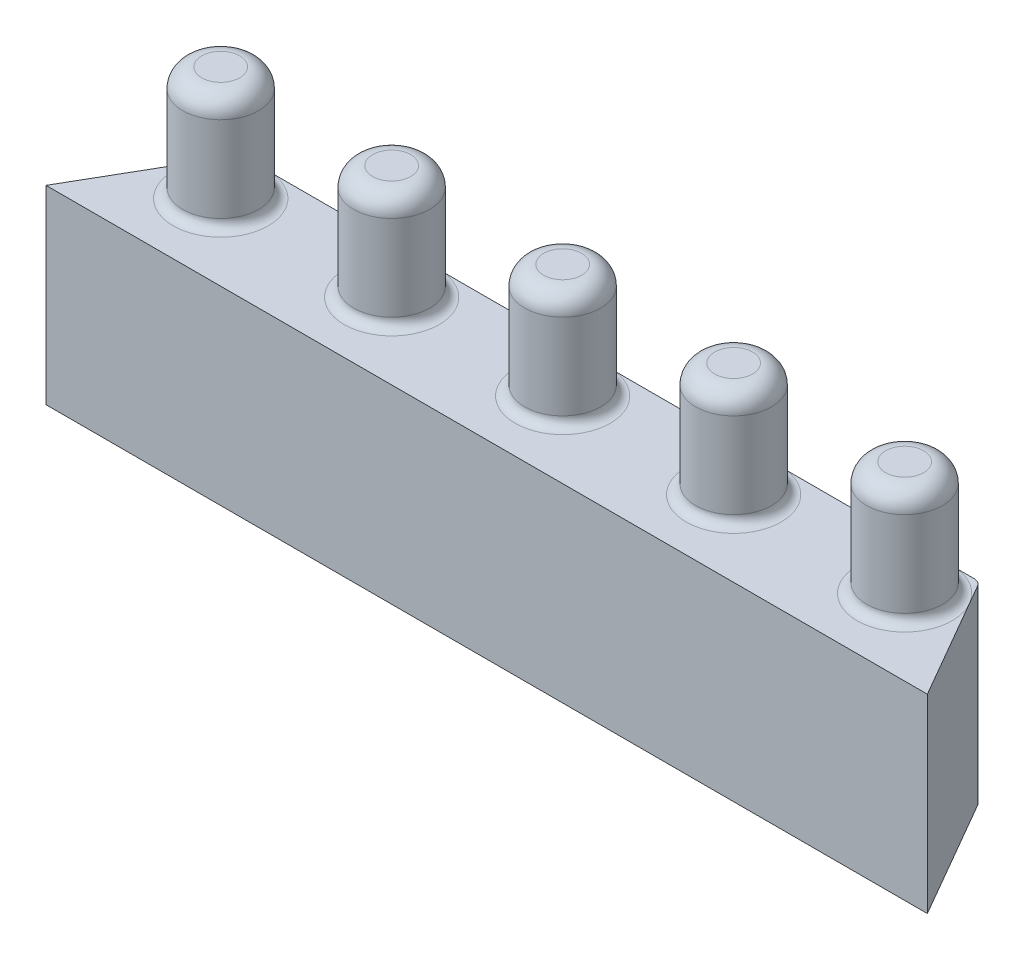
ISO-10303-21;
HEADER;
FILE_DESCRIPTION(('STEP AP214'),'2;1');
FILE_NAME('part.step','',(''),(''),'','','');
FILE_SCHEMA(('AUTOMOTIVE_DESIGN { 1 0 10303 214 1 1 1 1 }'));
ENDSEC;
DATA;
#1=APPLICATION_CONTEXT('core data for automotive mechanical design processes');
#2=APPLICATION_PROTOCOL_DEFINITION('international standard','automotive_design',2000,#1);
#3=PRODUCT_CONTEXT('',#1,'mechanical');
#4=PRODUCT('Part','Part','',(#3));
#5=PRODUCT_RELATED_PRODUCT_CATEGORY('part','',(#4));
#6=PRODUCT_DEFINITION_FORMATION('','',#4);
#7=PRODUCT_DEFINITION_CONTEXT('part definition',#1,'design');
#8=PRODUCT_DEFINITION('design','',#6,#7);
#9=PRODUCT_DEFINITION_SHAPE('','',#8);
#10=(LENGTH_UNIT() NAMED_UNIT(*) SI_UNIT(.MILLI.,.METRE.));
#11=(NAMED_UNIT(*) PLANE_ANGLE_UNIT() SI_UNIT($,.RADIAN.));
#12=(NAMED_UNIT(*) SI_UNIT($,.STERADIAN.) SOLID_ANGLE_UNIT());
#13=UNCERTAINTY_MEASURE_WITH_UNIT(LENGTH_MEASURE(1.E-05),#10,'distance_accuracy_value','');
#14=(GEOMETRIC_REPRESENTATION_CONTEXT(3) GLOBAL_UNCERTAINTY_ASSIGNED_CONTEXT((#13)) GLOBAL_UNIT_ASSIGNED_CONTEXT((#10,
#11,#12)) REPRESENTATION_CONTEXT('',''));
#15=CARTESIAN_POINT('',(0.,0.,0.));
#16=DIRECTION('',(0.,0.,1.));
#17=DIRECTION('',(1.,0.,0.));
#18=AXIS2_PLACEMENT_3D('',#15,#16,#17);
#19=CARTESIAN_POINT('',(0.,10.,0.));
#20=DIRECTION('',(0.,1.,0.));
#21=DIRECTION('',(0.,0.,1.));
#22=AXIS2_PLACEMENT_3D('',#19,#20,#21);
#23=PLANE('',#22);
#24=DIRECTION('',(-0.500000000000005,0.,-0.866025403784436));
#25=VECTOR('',#24,1.);
#26=CARTESIAN_POINT('',(37.443375672974,10.,-2.5));
#27=LINE('',#26,#25);
#28=CARTESIAN_POINT('',(38.1650635094611,10.,-1.25000000000001));
#29=VERTEX_POINT('',#28);
#30=CARTESIAN_POINT('',(37.5877132402715,10.,-2.25000000000001));
#31=VERTEX_POINT('',#30);
#32=EDGE_CURVE('E130',#29,#31,#27,.T.);
#33=ORIENTED_EDGE('',*,*,#32,.T.);
#34=CARTESIAN_POINT('',(37.1547005383792,10.,-2.));
#35=DIRECTION('',(0.,1.,0.));
#36=DIRECTION('',(0.,0.,1.));
#37=AXIS2_PLACEMENT_3D('',#34,#35,#36);
#38=CIRCLE('',#37,0.5);
#39=CARTESIAN_POINT('',(37.1547005383792,10.,-2.5));
#40=VERTEX_POINT('',#39);
#41=EDGE_CURVE('E199',#31,#40,#38,.T.);
#42=ORIENTED_EDGE('',*,*,#41,.T.);
#43=DIRECTION('',(-1.,0.,0.));
#44=VECTOR('',#43,1.);
#45=CARTESIAN_POINT('',(-1.44337567297406,10.,-2.5));
#46=LINE('',#45,#44);
#47=CARTESIAN_POINT('',(36.,10.,-2.5));
#48=VERTEX_POINT('',#47);
#49=EDGE_CURVE('E142',#40,#48,#46,.T.);
#50=ORIENTED_EDGE('',*,*,#49,.T.);
#51=CARTESIAN_POINT('',(36.,10.,0.));
#52=DIRECTION('',(0.,1.,0.));
#53=DIRECTION('',(0.,0.,1.));
#54=AXIS2_PLACEMENT_3D('',#51,#52,#53);
#55=CIRCLE('',#54,2.5);
#56=EDGE_CURVE('E197',#48,#29,#55,.F.);
#57=ORIENTED_EDGE('',*,*,#56,.T.);
#58=EDGE_LOOP('',(#33,#42,#50,#57));
#59=FACE_BOUND('',#58,.T.);
#60=ADVANCED_FACE('F33',(#59),#23,.T.);
#61=CARTESIAN_POINT('',(0.,10.,-2.5));
#62=VERTEX_POINT('',#61);
#63=CARTESIAN_POINT('',(-1.15470053837925,10.,-2.5));
#64=VERTEX_POINT('',#63);
#65=EDGE_CURVE('E558',#62,#64,#46,.T.);
#66=ORIENTED_EDGE('',*,*,#65,.T.);
#67=CARTESIAN_POINT('',(-1.15470053837925,10.,-2.));
#68=DIRECTION('',(0.,1.,0.));
#69=DIRECTION('',(0.,0.,1.));
#70=AXIS2_PLACEMENT_3D('',#67,#68,#69);
#71=CIRCLE('',#70,0.5);
#72=CARTESIAN_POINT('',(-1.58771324027146,10.,-2.25));
#73=VERTEX_POINT('',#72);
#74=EDGE_CURVE('E201',#64,#73,#71,.T.);
#75=ORIENTED_EDGE('',*,*,#74,.T.);
#76=DIRECTION('',(-0.500000000000004,0.,0.866025403784436));
#77=VECTOR('',#76,1.);
#78=CARTESIAN_POINT('',(-1.44337567297406,10.,-2.5));
#79=LINE('',#78,#77);
#80=CARTESIAN_POINT('',(-2.16506350946109,10.,-1.25000000000001));
#81=VERTEX_POINT('',#80);
#82=EDGE_CURVE('E120',#73,#81,#79,.T.);
#83=ORIENTED_EDGE('',*,*,#82,.T.);
#84=CARTESIAN_POINT('',(0.,10.,0.));
#85=DIRECTION('',(0.,1.,0.));
#86=DIRECTION('',(0.,0.,1.));
#87=AXIS2_PLACEMENT_3D('',#84,#85,#86);
#88=CIRCLE('',#87,2.5);
#89=EDGE_CURVE('E184',#81,#62,#88,.F.);
#90=ORIENTED_EDGE('',*,*,#89,.T.);
#91=EDGE_LOOP('',(#66,#75,#83,#90));
#92=FACE_BOUND('',#91,.T.);
#93=ADVANCED_FACE('F231',(#92),#23,.T.);
#94=CARTESIAN_POINT('',(41.1961524227067,10.,4.));
#95=VERTEX_POINT('',#94);
#96=EDGE_CURVE('E562',#95,#29,#27,.T.);
#97=ORIENTED_EDGE('',*,*,#96,.T.);
#98=CARTESIAN_POINT('',(36.,10.,0.));
#99=DIRECTION('',(0.,1.,0.));
#100=DIRECTION('',(0.,0.,1.));
#101=AXIS2_PLACEMENT_3D('',#98,#99,#100);
#102=CIRCLE('',#101,2.5);
#103=EDGE_CURVE('E55',#29,#48,#102,.F.);
#104=ORIENTED_EDGE('',*,*,#103,.T.);
#105=CARTESIAN_POINT('',(27.,10.,-2.5));
#106=VERTEX_POINT('',#105);
#107=EDGE_CURVE('E548',#48,#106,#46,.T.);
#108=ORIENTED_EDGE('',*,*,#107,.T.);
#109=CARTESIAN_POINT('',(27.,10.,0.));
#110=DIRECTION('',(0.,1.,0.));
#111=DIRECTION('',(0.,0.,1.));
#112=AXIS2_PLACEMENT_3D('',#109,#110,#111);
#113=CIRCLE('',#112,2.5);
#114=EDGE_CURVE('E193',#106,#106,#113,.F.);
#115=ORIENTED_EDGE('',*,*,#114,.T.);
#116=CARTESIAN_POINT('',(18.,10.,-2.5));
#117=VERTEX_POINT('',#116);
#118=EDGE_CURVE('E546',#106,#117,#46,.T.);
#119=ORIENTED_EDGE('',*,*,#118,.T.);
#120=CARTESIAN_POINT('',(18.,10.,0.));
#121=DIRECTION('',(0.,1.,0.));
#122=DIRECTION('',(0.,0.,1.));
#123=AXIS2_PLACEMENT_3D('',#120,#121,#122);
#124=CIRCLE('',#123,2.50000000000004);
#125=EDGE_CURVE('E190',#117,#117,#124,.F.);
#126=ORIENTED_EDGE('',*,*,#125,.T.);
#127=CARTESIAN_POINT('',(9.,10.,-2.5));
#128=VERTEX_POINT('',#127);
#129=EDGE_CURVE('E555',#117,#128,#46,.T.);
#130=ORIENTED_EDGE('',*,*,#129,.T.);
#131=CARTESIAN_POINT('',(9.,10.,0.));
#132=DIRECTION('',(0.,1.,0.));
#133=DIRECTION('',(0.,0.,1.));
#134=AXIS2_PLACEMENT_3D('',#131,#132,#133);
#135=CIRCLE('',#134,2.5);
#136=EDGE_CURVE('E187',#128,#128,#135,.F.);
#137=ORIENTED_EDGE('',*,*,#136,.T.);
#138=EDGE_CURVE('E557',#128,#62,#46,.T.);
#139=ORIENTED_EDGE('',*,*,#138,.T.);
#140=CARTESIAN_POINT('',(0.,10.,0.));
#141=DIRECTION('',(0.,1.,0.));
#142=DIRECTION('',(0.,0.,1.));
#143=AXIS2_PLACEMENT_3D('',#140,#141,#142);
#144=CIRCLE('',#143,2.5);
#145=EDGE_CURVE('E115',#62,#81,#144,.F.);
#146=ORIENTED_EDGE('',*,*,#145,.T.);
#147=CARTESIAN_POINT('',(-5.19615242270667,10.,4.));
#148=VERTEX_POINT('',#147);
#149=EDGE_CURVE('E108',#81,#148,#79,.T.);
#150=ORIENTED_EDGE('',*,*,#149,.T.);
#151=DIRECTION('',(1.,0.,0.));
#152=VECTOR('',#151,1.);
#153=CARTESIAN_POINT('',(-5.19615242270667,10.,4.));
#154=LINE('',#153,#152);
#155=EDGE_CURVE('E112',#148,#95,#154,.T.);
#156=ORIENTED_EDGE('',*,*,#155,.T.);
#157=EDGE_LOOP('',(#97,#104,#108,#115,#119,#126,#130,#137,#139,#146,#150,#156));
#158=FACE_BOUND('',#157,.T.);
#159=ADVANCED_FACE('F111',(#158),#23,.T.);
#160=CARTESIAN_POINT('',(0.,0.,0.));
#161=DIRECTION('',(0.,1.,0.));
#162=DIRECTION('',(0.,0.,1.));
#163=AXIS2_PLACEMENT_3D('',#160,#161,#162);
#164=PLANE('',#163);
#165=DIRECTION('',(-0.500000000000004,0.,0.866025403784436));
#166=VECTOR('',#165,1.);
#167=CARTESIAN_POINT('',(-1.44337567297406,0.,-2.5));
#168=LINE('',#167,#166);
#169=CARTESIAN_POINT('',(-1.58771324027146,0.,-2.25));
#170=VERTEX_POINT('',#169);
#171=CARTESIAN_POINT('',(-5.19615242270667,0.,4.));
#172=VERTEX_POINT('',#171);
#173=EDGE_CURVE('E135',#170,#172,#168,.T.);
#174=ORIENTED_EDGE('',*,*,#173,.F.);
#175=CARTESIAN_POINT('',(-1.15470053837925,0.,-2.));
#176=DIRECTION('',(0.,1.,0.));
#177=DIRECTION('',(0.,0.,1.));
#178=AXIS2_PLACEMENT_3D('',#175,#176,#177);
#179=CIRCLE('',#178,0.5);
#180=CARTESIAN_POINT('',(-1.15470053837925,0.,-2.5));
#181=VERTEX_POINT('',#180);
#182=EDGE_CURVE('E176',#170,#181,#179,.F.);
#183=ORIENTED_EDGE('',*,*,#182,.T.);
#184=DIRECTION('',(-1.,0.,0.));
#185=VECTOR('',#184,1.);
#186=CARTESIAN_POINT('',(-1.44337567297406,0.,-2.5));
#187=LINE('',#186,#185);
#188=CARTESIAN_POINT('',(37.1547005383792,0.,-2.5));
#189=VERTEX_POINT('',#188);
#190=EDGE_CURVE('E121',#189,#181,#187,.T.);
#191=ORIENTED_EDGE('',*,*,#190,.F.);
#192=CARTESIAN_POINT('',(37.1547005383792,0.,-2.));
#193=DIRECTION('',(0.,1.,0.));
#194=DIRECTION('',(0.,0.,1.));
#195=AXIS2_PLACEMENT_3D('',#192,#193,#194);
#196=CIRCLE('',#195,0.5);
#197=CARTESIAN_POINT('',(37.5877132402715,0.,-2.25000000000001));
#198=VERTEX_POINT('',#197);
#199=EDGE_CURVE('E174',#189,#198,#196,.F.);
#200=ORIENTED_EDGE('',*,*,#199,.T.);
#201=DIRECTION('',(-0.500000000000005,0.,-0.866025403784436));
#202=VECTOR('',#201,1.);
#203=CARTESIAN_POINT('',(37.443375672974,0.,-2.5));
#204=LINE('',#203,#202);
#205=CARTESIAN_POINT('',(41.1961524227067,0.,4.));
#206=VERTEX_POINT('',#205);
#207=EDGE_CURVE('E566',#206,#198,#204,.T.);
#208=ORIENTED_EDGE('',*,*,#207,.F.);
#209=DIRECTION('',(1.,0.,0.));
#210=VECTOR('',#209,1.);
#211=CARTESIAN_POINT('',(-5.19615242270667,0.,4.));
#212=LINE('',#211,#210);
#213=EDGE_CURVE('E564',#172,#206,#212,.T.);
#214=ORIENTED_EDGE('',*,*,#213,.F.);
#215=EDGE_LOOP('',(#174,#183,#191,#200,#208,#214));
#216=FACE_BOUND('',#215,.T.);
#217=ADVANCED_FACE('F241',(#216),#164,.F.);
#218=CARTESIAN_POINT('',(-1.44337567297406,10.,-2.5));
#219=DIRECTION('',(0.866025403784436,0.,0.500000000000004));
#220=DIRECTION('',(0.500000000000004,0.,-0.866025403784436));
#221=AXIS2_PLACEMENT_3D('',#218,#219,#220);
#222=PLANE('',#221);
#223=ORIENTED_EDGE('',*,*,#82,.F.);
#224=DIRECTION('',(0.,-1.,0.));
#225=VECTOR('',#224,1.);
#226=CARTESIAN_POINT('',(-1.58771324027146,10.,-2.25));
#227=LINE('',#226,#225);
#228=EDGE_CURVE('E172',#73,#170,#227,.T.);
#229=ORIENTED_EDGE('',*,*,#228,.T.);
#230=ORIENTED_EDGE('',*,*,#173,.T.);
#231=DIRECTION('',(0.,-1.,0.));
#232=VECTOR('',#231,1.);
#233=CARTESIAN_POINT('',(-5.19615242270667,10.,4.));
#234=LINE('',#233,#232);
#235=EDGE_CURVE('E126',#148,#172,#234,.T.);
#236=ORIENTED_EDGE('',*,*,#235,.F.);
#237=ORIENTED_EDGE('',*,*,#149,.F.);
#238=EDGE_LOOP('',(#223,#229,#230,#236,#237));
#239=FACE_BOUND('',#238,.T.);
#240=ADVANCED_FACE('F132',(#239),#222,.F.);
#241=CARTESIAN_POINT('',(-5.19615242270667,10.,4.));
#242=DIRECTION('',(0.,0.,-1.));
#243=DIRECTION('',(-1.,0.,0.));
#244=AXIS2_PLACEMENT_3D('',#241,#242,#243);
#245=PLANE('',#244);
#246=ORIENTED_EDGE('',*,*,#213,.T.);
#247=DIRECTION('',(0.,-1.,0.));
#248=VECTOR('',#247,1.);
#249=CARTESIAN_POINT('',(41.1961524227067,10.,4.));
#250=LINE('',#249,#248);
#251=EDGE_CURVE('E128',#95,#206,#250,.T.);
#252=ORIENTED_EDGE('',*,*,#251,.F.);
#253=ORIENTED_EDGE('',*,*,#155,.F.);
#254=ORIENTED_EDGE('',*,*,#235,.T.);
#255=EDGE_LOOP('',(#246,#252,#253,#254));
#256=FACE_BOUND('',#255,.T.);
#257=ADVANCED_FACE('F125',(#256),#245,.F.);
#258=CARTESIAN_POINT('',(37.443375672974,10.,-2.5));
#259=DIRECTION('',(-0.866025403784436,0.,0.500000000000005));
#260=DIRECTION('',(0.500000000000005,0.,0.866025403784436));
#261=AXIS2_PLACEMENT_3D('',#258,#259,#260);
#262=PLANE('',#261);
#263=ORIENTED_EDGE('',*,*,#207,.T.);
#264=DIRECTION('',(0.,-1.,0.));
#265=VECTOR('',#264,1.);
#266=CARTESIAN_POINT('',(37.5877132402715,10.,-2.25000000000001));
#267=LINE('',#266,#265);
#268=EDGE_CURVE('E48',#198,#31,#267,.F.);
#269=ORIENTED_EDGE('',*,*,#268,.T.);
#270=ORIENTED_EDGE('',*,*,#32,.F.);
#271=ORIENTED_EDGE('',*,*,#96,.F.);
#272=ORIENTED_EDGE('',*,*,#251,.T.);
#273=EDGE_LOOP('',(#263,#269,#270,#271,#272));
#274=FACE_BOUND('',#273,.T.);
#275=ADVANCED_FACE('F255',(#274),#262,.F.);
#276=CARTESIAN_POINT('',(-1.44337567297406,10.,-2.5));
#277=DIRECTION('',(0.,0.,1.));
#278=DIRECTION('',(1.,0.,0.));
#279=AXIS2_PLACEMENT_3D('',#276,#277,#278);
#280=PLANE('',#279);
#281=ORIENTED_EDGE('',*,*,#190,.T.);
#282=DIRECTION('',(0.,-1.,0.));
#283=VECTOR('',#282,1.);
#284=CARTESIAN_POINT('',(-1.15470053837925,10.,-2.5));
#285=LINE('',#284,#283);
#286=EDGE_CURVE('E181',#181,#64,#285,.F.);
#287=ORIENTED_EDGE('',*,*,#286,.T.);
#288=ORIENTED_EDGE('',*,*,#65,.F.);
#289=ORIENTED_EDGE('',*,*,#138,.F.);
#290=ORIENTED_EDGE('',*,*,#129,.F.);
#291=ORIENTED_EDGE('',*,*,#118,.F.);
#292=ORIENTED_EDGE('',*,*,#107,.F.);
#293=ORIENTED_EDGE('',*,*,#49,.F.);
#294=DIRECTION('',(0.,-1.,0.));
#295=VECTOR('',#294,1.);
#296=CARTESIAN_POINT('',(37.1547005383792,10.,-2.5));
#297=LINE('',#296,#295);
#298=EDGE_CURVE('E178',#40,#189,#297,.T.);
#299=ORIENTED_EDGE('',*,*,#298,.T.);
#300=EDGE_LOOP('',(#281,#287,#288,#289,#290,#291,#292,#293,#299));
#301=FACE_BOUND('',#300,.T.);
#302=ADVANCED_FACE('F251',(#301),#280,.F.);
#303=CARTESIAN_POINT('',(0.,16.,0.));
#304=DIRECTION('',(0.,-1.,0.));
#305=DIRECTION('',(0.,0.,-1.));
#306=AXIS2_PLACEMENT_3D('',#303,#304,#305);
#307=CYLINDRICAL_SURFACE('',#306,2.);
#308=CARTESIAN_POINT('',(0.,10.5,0.));
#309=DIRECTION('',(0.,1.,0.));
#310=DIRECTION('',(0.,0.,1.));
#311=AXIS2_PLACEMENT_3D('',#308,#309,#310);
#312=CIRCLE('',#311,2.);
#313=CARTESIAN_POINT('',(0.,10.5,2.));
#314=VERTEX_POINT('',#313);
#315=EDGE_CURVE('E11',#314,#314,#312,.T.);
#316=ORIENTED_EDGE('',*,*,#315,.T.);
#317=EDGE_LOOP('',(#316));
#318=FACE_BOUND('',#317,.T.);
#319=CARTESIAN_POINT('',(0.,15.,0.));
#320=DIRECTION('',(0.,1.,0.));
#321=DIRECTION('',(0.,0.,1.));
#322=AXIS2_PLACEMENT_3D('',#319,#320,#321);
#323=CIRCLE('',#322,2.);
#324=CARTESIAN_POINT('',(0.,15.,2.));
#325=VERTEX_POINT('',#324);
#326=EDGE_CURVE('E140',#325,#325,#323,.F.);
#327=ORIENTED_EDGE('',*,*,#326,.T.);
#328=EDGE_LOOP('',(#327));
#329=FACE_BOUND('',#328,.T.);
#330=ADVANCED_FACE('F254',(#318,#329),#307,.T.);
#331=CARTESIAN_POINT('',(0.,16.,0.));
#332=DIRECTION('',(0.,1.,0.));
#333=DIRECTION('',(0.,0.,1.));
#334=AXIS2_PLACEMENT_3D('',#331,#332,#333);
#335=PLANE('',#334);
#336=CARTESIAN_POINT('',(0.,16.,0.));
#337=DIRECTION('',(0.,1.,0.));
#338=DIRECTION('',(0.,0.,1.));
#339=AXIS2_PLACEMENT_3D('',#336,#337,#338);
#340=CIRCLE('',#339,1.);
#341=CARTESIAN_POINT('',(0.,16.,1.));
#342=VERTEX_POINT('',#341);
#343=EDGE_CURVE('E137',#342,#342,#340,.T.);
#344=ORIENTED_EDGE('',*,*,#343,.T.);
#345=EDGE_LOOP('',(#344));
#346=FACE_BOUND('',#345,.T.);
#347=ADVANCED_FACE('F333',(#346),#335,.T.);
#348=CARTESIAN_POINT('',(9.,16.,0.));
#349=DIRECTION('',(0.,-1.,0.));
#350=DIRECTION('',(0.,0.,-1.));
#351=AXIS2_PLACEMENT_3D('',#348,#349,#350);
#352=CYLINDRICAL_SURFACE('',#351,2.);
#353=CARTESIAN_POINT('',(9.,10.5,0.));
#354=DIRECTION('',(0.,1.,0.));
#355=DIRECTION('',(0.,0.,1.));
#356=AXIS2_PLACEMENT_3D('',#353,#354,#355);
#357=CIRCLE('',#356,2.);
#358=CARTESIAN_POINT('',(9.,10.5,2.));
#359=VERTEX_POINT('',#358);
#360=EDGE_CURVE('E41',#359,#359,#357,.T.);
#361=ORIENTED_EDGE('',*,*,#360,.T.);
#362=EDGE_LOOP('',(#361));
#363=FACE_BOUND('',#362,.T.);
#364=CARTESIAN_POINT('',(9.,15.,0.));
#365=DIRECTION('',(0.,1.,0.));
#366=DIRECTION('',(0.,0.,1.));
#367=AXIS2_PLACEMENT_3D('',#364,#365,#366);
#368=CIRCLE('',#367,2.);
#369=CARTESIAN_POINT('',(9.,15.,2.));
#370=VERTEX_POINT('',#369);
#371=EDGE_CURVE('E151',#370,#370,#368,.F.);
#372=ORIENTED_EDGE('',*,*,#371,.T.);
#373=EDGE_LOOP('',(#372));
#374=FACE_BOUND('',#373,.T.);
#375=ADVANCED_FACE('F215',(#363,#374),#352,.T.);
#376=CARTESIAN_POINT('',(0.,16.,0.));
#377=DIRECTION('',(0.,1.,0.));
#378=DIRECTION('',(0.,0.,1.));
#379=AXIS2_PLACEMENT_3D('',#376,#377,#378);
#380=PLANE('',#379);
#381=CARTESIAN_POINT('',(9.,16.,0.));
#382=DIRECTION('',(0.,1.,0.));
#383=DIRECTION('',(0.,0.,1.));
#384=AXIS2_PLACEMENT_3D('',#381,#382,#383);
#385=CIRCLE('',#384,1.);
#386=CARTESIAN_POINT('',(9.,16.,1.));
#387=VERTEX_POINT('',#386);
#388=EDGE_CURVE('E148',#387,#387,#385,.T.);
#389=ORIENTED_EDGE('',*,*,#388,.T.);
#390=EDGE_LOOP('',(#389));
#391=FACE_BOUND('',#390,.T.);
#392=ADVANCED_FACE('F326',(#391),#380,.T.);
#393=CARTESIAN_POINT('',(18.,16.,0.));
#394=DIRECTION('',(0.,-1.,0.));
#395=DIRECTION('',(0.,0.,-1.));
#396=AXIS2_PLACEMENT_3D('',#393,#394,#395);
#397=CYLINDRICAL_SURFACE('',#396,2.00000000000004);
#398=CARTESIAN_POINT('',(18.,10.5,0.));
#399=DIRECTION('',(0.,1.,0.));
#400=DIRECTION('',(0.,0.,1.));
#401=AXIS2_PLACEMENT_3D('',#398,#399,#400);
#402=CIRCLE('',#401,2.00000000000004);
#403=CARTESIAN_POINT('',(18.,10.5,2.00000000000004));
#404=VERTEX_POINT('',#403);
#405=EDGE_CURVE('E210',#404,#404,#402,.T.);
#406=ORIENTED_EDGE('',*,*,#405,.T.);
#407=EDGE_LOOP('',(#406));
#408=FACE_BOUND('',#407,.T.);
#409=CARTESIAN_POINT('',(18.,15.,0.));
#410=DIRECTION('',(0.,1.,0.));
#411=DIRECTION('',(0.,0.,1.));
#412=AXIS2_PLACEMENT_3D('',#409,#410,#411);
#413=CIRCLE('',#412,2.00000000000004);
#414=CARTESIAN_POINT('',(18.,15.,2.00000000000004));
#415=VERTEX_POINT('',#414);
#416=EDGE_CURVE('E157',#415,#415,#413,.F.);
#417=ORIENTED_EDGE('',*,*,#416,.T.);
#418=EDGE_LOOP('',(#417));
#419=FACE_BOUND('',#418,.T.);
#420=ADVANCED_FACE('F322',(#408,#419),#397,.T.);
#421=CARTESIAN_POINT('',(0.,16.,0.));
#422=DIRECTION('',(0.,1.,0.));
#423=DIRECTION('',(0.,0.,1.));
#424=AXIS2_PLACEMENT_3D('',#421,#422,#423);
#425=PLANE('',#424);
#426=CARTESIAN_POINT('',(18.,16.,0.));
#427=DIRECTION('',(0.,1.,0.));
#428=DIRECTION('',(0.,0.,1.));
#429=AXIS2_PLACEMENT_3D('',#426,#427,#428);
#430=CIRCLE('',#429,1.00000000000004);
#431=CARTESIAN_POINT('',(18.,16.,1.00000000000004));
#432=VERTEX_POINT('',#431);
#433=EDGE_CURVE('E154',#432,#432,#430,.T.);
#434=ORIENTED_EDGE('',*,*,#433,.T.);
#435=EDGE_LOOP('',(#434));
#436=FACE_BOUND('',#435,.T.);
#437=ADVANCED_FACE('F304',(#436),#425,.T.);
#438=CARTESIAN_POINT('',(27.,16.,0.));
#439=DIRECTION('',(0.,-1.,0.));
#440=DIRECTION('',(0.,0.,-1.));
#441=AXIS2_PLACEMENT_3D('',#438,#439,#440);
#442=CYLINDRICAL_SURFACE('',#441,2.);
#443=CARTESIAN_POINT('',(27.,10.5,0.));
#444=DIRECTION('',(0.,1.,0.));
#445=DIRECTION('',(0.,0.,1.));
#446=AXIS2_PLACEMENT_3D('',#443,#444,#445);
#447=CIRCLE('',#446,2.);
#448=CARTESIAN_POINT('',(27.,10.5,2.));
#449=VERTEX_POINT('',#448);
#450=EDGE_CURVE('E207',#449,#449,#447,.T.);
#451=ORIENTED_EDGE('',*,*,#450,.T.);
#452=EDGE_LOOP('',(#451));
#453=FACE_BOUND('',#452,.T.);
#454=CARTESIAN_POINT('',(27.,15.,0.));
#455=DIRECTION('',(0.,1.,0.));
#456=DIRECTION('',(0.,0.,1.));
#457=AXIS2_PLACEMENT_3D('',#454,#455,#456);
#458=CIRCLE('',#457,2.);
#459=CARTESIAN_POINT('',(27.,15.,2.));
#460=VERTEX_POINT('',#459);
#461=EDGE_CURVE('E163',#460,#460,#458,.F.);
#462=ORIENTED_EDGE('',*,*,#461,.T.);
#463=EDGE_LOOP('',(#462));
#464=FACE_BOUND('',#463,.T.);
#465=ADVANCED_FACE('F300',(#453,#464),#442,.T.);
#466=CARTESIAN_POINT('',(0.,16.,0.));
#467=DIRECTION('',(0.,1.,0.));
#468=DIRECTION('',(0.,0.,1.));
#469=AXIS2_PLACEMENT_3D('',#466,#467,#468);
#470=PLANE('',#469);
#471=CARTESIAN_POINT('',(27.,16.,0.));
#472=DIRECTION('',(0.,1.,0.));
#473=DIRECTION('',(0.,0.,1.));
#474=AXIS2_PLACEMENT_3D('',#471,#472,#473);
#475=CIRCLE('',#474,0.999999999999999);
#476=CARTESIAN_POINT('',(27.,16.,0.999999999999999));
#477=VERTEX_POINT('',#476);
#478=EDGE_CURVE('E160',#477,#477,#475,.T.);
#479=ORIENTED_EDGE('',*,*,#478,.T.);
#480=EDGE_LOOP('',(#479));
#481=FACE_BOUND('',#480,.T.);
#482=ADVANCED_FACE('F303',(#481),#470,.T.);
#483=CARTESIAN_POINT('',(36.,16.,0.));
#484=DIRECTION('',(0.,-1.,0.));
#485=DIRECTION('',(0.,0.,-1.));
#486=AXIS2_PLACEMENT_3D('',#483,#484,#485);
#487=CYLINDRICAL_SURFACE('',#486,2.);
#488=CARTESIAN_POINT('',(36.,10.5,0.));
#489=DIRECTION('',(0.,1.,0.));
#490=DIRECTION('',(0.,0.,1.));
#491=AXIS2_PLACEMENT_3D('',#488,#489,#490);
#492=CIRCLE('',#491,2.);
#493=CARTESIAN_POINT('',(36.,10.5,2.));
#494=VERTEX_POINT('',#493);
#495=EDGE_CURVE('E204',#494,#494,#492,.T.);
#496=ORIENTED_EDGE('',*,*,#495,.T.);
#497=EDGE_LOOP('',(#496));
#498=FACE_BOUND('',#497,.T.);
#499=CARTESIAN_POINT('',(36.,15.,0.));
#500=DIRECTION('',(0.,1.,0.));
#501=DIRECTION('',(0.,0.,1.));
#502=AXIS2_PLACEMENT_3D('',#499,#500,#501);
#503=CIRCLE('',#502,2.);
#504=CARTESIAN_POINT('',(36.,15.,2.));
#505=VERTEX_POINT('',#504);
#506=EDGE_CURVE('E169',#505,#505,#503,.F.);
#507=ORIENTED_EDGE('',*,*,#506,.T.);
#508=EDGE_LOOP('',(#507));
#509=FACE_BOUND('',#508,.T.);
#510=ADVANCED_FACE('F311',(#498,#509),#487,.T.);
#511=CARTESIAN_POINT('',(0.,16.,0.));
#512=DIRECTION('',(0.,1.,0.));
#513=DIRECTION('',(0.,0.,1.));
#514=AXIS2_PLACEMENT_3D('',#511,#512,#513);
#515=PLANE('',#514);
#516=CARTESIAN_POINT('',(36.,16.,0.));
#517=DIRECTION('',(0.,1.,0.));
#518=DIRECTION('',(0.,0.,1.));
#519=AXIS2_PLACEMENT_3D('',#516,#517,#518);
#520=CIRCLE('',#519,1.);
#521=CARTESIAN_POINT('',(36.,16.,1.));
#522=VERTEX_POINT('',#521);
#523=EDGE_CURVE('E166',#522,#522,#520,.T.);
#524=ORIENTED_EDGE('',*,*,#523,.T.);
#525=EDGE_LOOP('',(#524));
#526=FACE_BOUND('',#525,.T.);
#527=ADVANCED_FACE('F265',(#526),#515,.T.);
#528=CARTESIAN_POINT('',(0.,15.,0.));
#529=DIRECTION('',(0.,1.,0.));
#530=DIRECTION('',(0.,0.,1.));
#531=AXIS2_PLACEMENT_3D('',#528,#529,#530);
#532=DEGENERATE_TOROIDAL_SURFACE('',#531,1.,1.,.T.);
#533=ORIENTED_EDGE('',*,*,#326,.F.);
#534=EDGE_LOOP('',(#533));
#535=FACE_BOUND('',#534,.T.);
#536=ORIENTED_EDGE('',*,*,#343,.F.);
#537=EDGE_LOOP('',(#536));
#538=FACE_BOUND('',#537,.T.);
#539=ADVANCED_FACE('F261',(#535,#538),#532,.T.);
#540=CARTESIAN_POINT('',(9.,15.,0.));
#541=DIRECTION('',(0.,1.,0.));
#542=DIRECTION('',(0.,0.,1.));
#543=AXIS2_PLACEMENT_3D('',#540,#541,#542);
#544=DEGENERATE_TOROIDAL_SURFACE('',#543,1.,1.,.T.);
#545=ORIENTED_EDGE('',*,*,#371,.F.);
#546=EDGE_LOOP('',(#545));
#547=FACE_BOUND('',#546,.T.);
#548=ORIENTED_EDGE('',*,*,#388,.F.);
#549=EDGE_LOOP('',(#548));
#550=FACE_BOUND('',#549,.T.);
#551=ADVANCED_FACE('F264',(#547,#550),#544,.T.);
#552=CARTESIAN_POINT('',(18.,15.,0.));
#553=DIRECTION('',(0.,1.,0.));
#554=DIRECTION('',(0.,0.,1.));
#555=AXIS2_PLACEMENT_3D('',#552,#553,#554);
#556=TOROIDAL_SURFACE('',#555,1.00000000000004,1.);
#557=ORIENTED_EDGE('',*,*,#416,.F.);
#558=EDGE_LOOP('',(#557));
#559=FACE_BOUND('',#558,.T.);
#560=ORIENTED_EDGE('',*,*,#433,.F.);
#561=EDGE_LOOP('',(#560));
#562=FACE_BOUND('',#561,.T.);
#563=ADVANCED_FACE('F269',(#559,#562),#556,.T.);
#564=CARTESIAN_POINT('',(27.,15.,0.));
#565=DIRECTION('',(0.,1.,0.));
#566=DIRECTION('',(0.,0.,1.));
#567=AXIS2_PLACEMENT_3D('',#564,#565,#566);
#568=DEGENERATE_TOROIDAL_SURFACE('',#567,0.999999999999999,1.,.T.);
#569=ORIENTED_EDGE('',*,*,#461,.F.);
#570=EDGE_LOOP('',(#569));
#571=FACE_BOUND('',#570,.T.);
#572=ORIENTED_EDGE('',*,*,#478,.F.);
#573=EDGE_LOOP('',(#572));
#574=FACE_BOUND('',#573,.T.);
#575=ADVANCED_FACE('F273',(#571,#574),#568,.T.);
#576=CARTESIAN_POINT('',(36.,15.,0.));
#577=DIRECTION('',(0.,1.,0.));
#578=DIRECTION('',(0.,0.,1.));
#579=AXIS2_PLACEMENT_3D('',#576,#577,#578);
#580=TOROIDAL_SURFACE('',#579,1.,1.);
#581=ORIENTED_EDGE('',*,*,#506,.F.);
#582=EDGE_LOOP('',(#581));
#583=FACE_BOUND('',#582,.T.);
#584=ORIENTED_EDGE('',*,*,#523,.F.);
#585=EDGE_LOOP('',(#584));
#586=FACE_BOUND('',#585,.T.);
#587=ADVANCED_FACE('F277',(#583,#586),#580,.T.);
#588=CARTESIAN_POINT('',(-1.15470053837925,10.,-2.));
#589=DIRECTION('',(0.,-1.,0.));
#590=DIRECTION('',(0.,0.,-1.));
#591=AXIS2_PLACEMENT_3D('',#588,#589,#590);
#592=CYLINDRICAL_SURFACE('',#591,0.5);
#593=ORIENTED_EDGE('',*,*,#74,.F.);
#594=ORIENTED_EDGE('',*,*,#286,.F.);
#595=ORIENTED_EDGE('',*,*,#182,.F.);
#596=ORIENTED_EDGE('',*,*,#228,.F.);
#597=EDGE_LOOP('',(#593,#594,#595,#596));
#598=FACE_BOUND('',#597,.T.);
#599=ADVANCED_FACE('F281',(#598),#592,.T.);
#600=CARTESIAN_POINT('',(37.1547005383792,10.,-2.));
#601=DIRECTION('',(0.,-1.,0.));
#602=DIRECTION('',(0.,0.,-1.));
#603=AXIS2_PLACEMENT_3D('',#600,#601,#602);
#604=CYLINDRICAL_SURFACE('',#603,0.5);
#605=ORIENTED_EDGE('',*,*,#41,.F.);
#606=ORIENTED_EDGE('',*,*,#268,.F.);
#607=ORIENTED_EDGE('',*,*,#199,.F.);
#608=ORIENTED_EDGE('',*,*,#298,.F.);
#609=EDGE_LOOP('',(#605,#606,#607,#608));
#610=FACE_BOUND('',#609,.T.);
#611=ADVANCED_FACE('F285',(#610),#604,.T.);
#612=CARTESIAN_POINT('',(36.,10.5,0.));
#613=DIRECTION('',(0.,1.,0.));
#614=DIRECTION('',(0.,0.,1.));
#615=AXIS2_PLACEMENT_3D('',#612,#613,#614);
#616=TOROIDAL_SURFACE('',#615,2.5,0.5);
#617=ORIENTED_EDGE('',*,*,#103,.F.);
#618=ORIENTED_EDGE('',*,*,#56,.F.);
#619=EDGE_LOOP('',(#617,#618));
#620=FACE_BOUND('',#619,.T.);
#621=ORIENTED_EDGE('',*,*,#495,.F.);
#622=EDGE_LOOP('',(#621));
#623=FACE_BOUND('',#622,.T.);
#624=ADVANCED_FACE('F289',(#620,#623),#616,.F.);
#625=CARTESIAN_POINT('',(27.,10.5,0.));
#626=DIRECTION('',(0.,1.,0.));
#627=DIRECTION('',(0.,0.,1.));
#628=AXIS2_PLACEMENT_3D('',#625,#626,#627);
#629=TOROIDAL_SURFACE('',#628,2.5,0.5);
#630=ORIENTED_EDGE('',*,*,#114,.F.);
#631=EDGE_LOOP('',(#630));
#632=FACE_BOUND('',#631,.T.);
#633=ORIENTED_EDGE('',*,*,#450,.F.);
#634=EDGE_LOOP('',(#633));
#635=FACE_BOUND('',#634,.T.);
#636=ADVANCED_FACE('F227',(#632,#635),#629,.F.);
#637=CARTESIAN_POINT('',(18.,10.5,0.));
#638=DIRECTION('',(0.,1.,0.));
#639=DIRECTION('',(0.,0.,1.));
#640=AXIS2_PLACEMENT_3D('',#637,#638,#639);
#641=TOROIDAL_SURFACE('',#640,2.50000000000004,0.5);
#642=ORIENTED_EDGE('',*,*,#125,.F.);
#643=EDGE_LOOP('',(#642));
#644=FACE_BOUND('',#643,.T.);
#645=ORIENTED_EDGE('',*,*,#405,.F.);
#646=EDGE_LOOP('',(#645));
#647=FACE_BOUND('',#646,.T.);
#648=ADVANCED_FACE('F220',(#644,#647),#641,.F.);
#649=CARTESIAN_POINT('',(9.,10.5,0.));
#650=DIRECTION('',(0.,1.,0.));
#651=DIRECTION('',(0.,0.,1.));
#652=AXIS2_PLACEMENT_3D('',#649,#650,#651);
#653=TOROIDAL_SURFACE('',#652,2.5,0.5);
#654=ORIENTED_EDGE('',*,*,#136,.F.);
#655=EDGE_LOOP('',(#654));
#656=FACE_BOUND('',#655,.T.);
#657=ORIENTED_EDGE('',*,*,#360,.F.);
#658=EDGE_LOOP('',(#657));
#659=FACE_BOUND('',#658,.T.);
#660=ADVANCED_FACE('F218',(#656,#659),#653,.F.);
#661=CARTESIAN_POINT('',(0.,10.5,0.));
#662=DIRECTION('',(0.,1.,0.));
#663=DIRECTION('',(0.,0.,1.));
#664=AXIS2_PLACEMENT_3D('',#661,#662,#663);
#665=TOROIDAL_SURFACE('',#664,2.5,0.5);
#666=ORIENTED_EDGE('',*,*,#145,.F.);
#667=ORIENTED_EDGE('',*,*,#89,.F.);
#668=EDGE_LOOP('',(#666,#667));
#669=FACE_BOUND('',#668,.T.);
#670=ORIENTED_EDGE('',*,*,#315,.F.);
#671=EDGE_LOOP('',(#670));
#672=FACE_BOUND('',#671,.T.);
#673=ADVANCED_FACE('F35',(#669,#672),#665,.F.);
#674=CLOSED_SHELL('',(#60,#93,#159,#217,#240,#257,#275,#302,#330,#347,#375,#392,#420,#437,#465,
#482,#510,#527,#539,#551,#563,#575,#587,#599,#611,#624,#636,#648,#660,#673));
#675=MANIFOLD_SOLID_BREP('B2',#674);
#676=ADVANCED_BREP_SHAPE_REPRESENTATION('',(#18,#675),#14);
#677=SHAPE_DEFINITION_REPRESENTATION(#9,#676);
ENDSEC;
END-ISO-10303-21;
